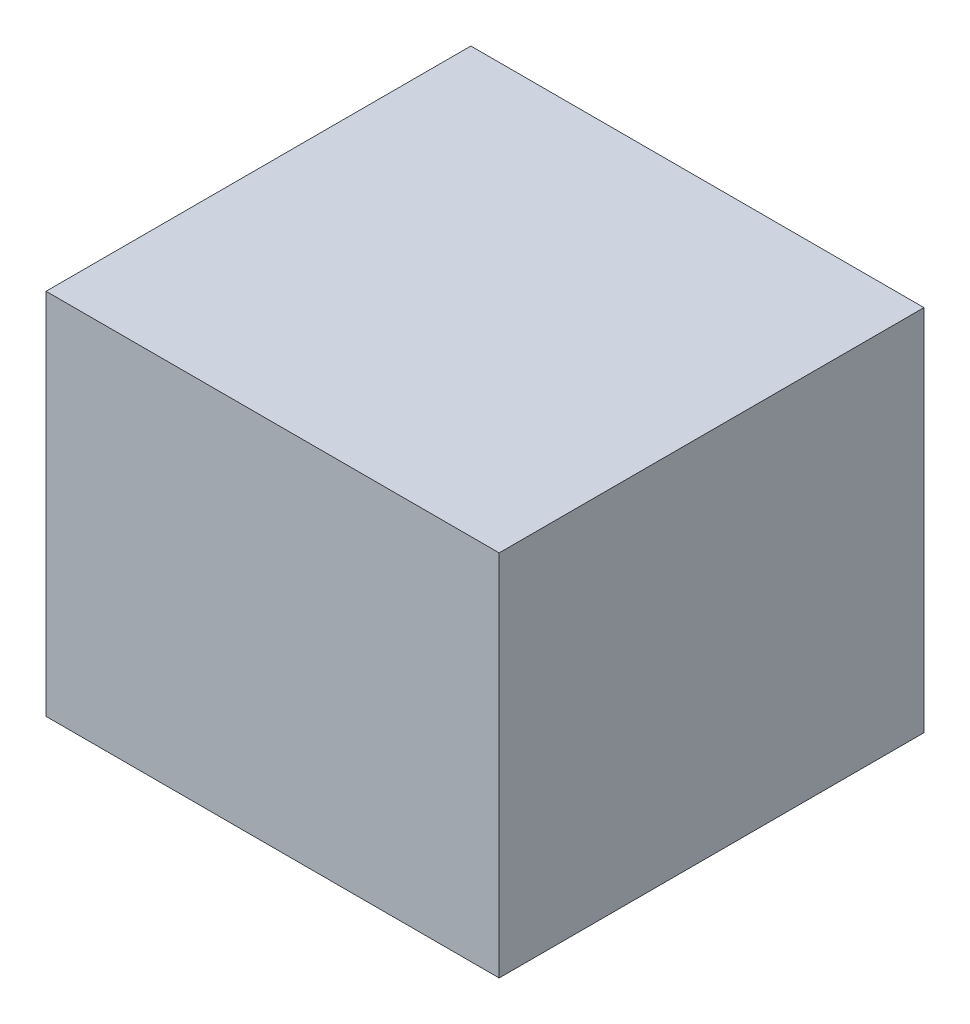
ISO-10303-21;
HEADER;
FILE_DESCRIPTION(('STEP AP214'),'2;1');
FILE_NAME('part.step','',(''),(''),'','','');
FILE_SCHEMA(('AUTOMOTIVE_DESIGN { 1 0 10303 214 1 1 1 1 }'));
ENDSEC;
DATA;
#1=APPLICATION_CONTEXT('core data for automotive mechanical design processes');
#2=APPLICATION_PROTOCOL_DEFINITION('international standard','automotive_design',2000,#1);
#3=PRODUCT_CONTEXT('',#1,'mechanical');
#4=PRODUCT('Part','Part','',(#3));
#5=PRODUCT_RELATED_PRODUCT_CATEGORY('part','',(#4));
#6=PRODUCT_DEFINITION_FORMATION('','',#4);
#7=PRODUCT_DEFINITION_CONTEXT('part definition',#1,'design');
#8=PRODUCT_DEFINITION('design','',#6,#7);
#9=PRODUCT_DEFINITION_SHAPE('','',#8);
#10=(LENGTH_UNIT() NAMED_UNIT(*) SI_UNIT(.MILLI.,.METRE.));
#11=(NAMED_UNIT(*) PLANE_ANGLE_UNIT() SI_UNIT($,.RADIAN.));
#12=(NAMED_UNIT(*) SI_UNIT($,.STERADIAN.) SOLID_ANGLE_UNIT());
#13=UNCERTAINTY_MEASURE_WITH_UNIT(LENGTH_MEASURE(1.E-05),#10,'distance_accuracy_value','');
#14=(GEOMETRIC_REPRESENTATION_CONTEXT(3) GLOBAL_UNCERTAINTY_ASSIGNED_CONTEXT((#13)) GLOBAL_UNIT_ASSIGNED_CONTEXT((#10,
#11,#12)) REPRESENTATION_CONTEXT('',''));
#15=CARTESIAN_POINT('',(0.,0.,0.));
#16=DIRECTION('',(0.,0.,1.));
#17=DIRECTION('',(1.,0.,0.));
#18=AXIS2_PLACEMENT_3D('',#15,#16,#17);
#19=CARTESIAN_POINT('',(0.,0.,47.625));
#20=DIRECTION('',(1.,0.,0.));
#21=DIRECTION('',(0.,1.,0.));
#22=AXIS2_PLACEMENT_3D('',#19,#20,#21);
#23=PLANE('',#22);
#24=DIRECTION('',(0.,-1.,0.));
#25=VECTOR('',#24,1.);
#26=CARTESIAN_POINT('',(0.,0.,0.));
#27=LINE('',#26,#25);
#28=CARTESIAN_POINT('',(0.,0.,0.));
#29=VERTEX_POINT('',#28);
#30=CARTESIAN_POINT('',(0.,-41.275,0.));
#31=VERTEX_POINT('',#30);
#32=EDGE_CURVE('E102',#29,#31,#27,.T.);
#33=ORIENTED_EDGE('',*,*,#32,.T.);
#34=DIRECTION('',(0.,0.,-1.));
#35=VECTOR('',#34,1.);
#36=CARTESIAN_POINT('',(0.,-41.275,47.625));
#37=LINE('',#36,#35);
#38=CARTESIAN_POINT('',(0.,-41.275,47.625));
#39=VERTEX_POINT('',#38);
#40=EDGE_CURVE('E11',#39,#31,#37,.T.);
#41=ORIENTED_EDGE('',*,*,#40,.F.);
#42=DIRECTION('',(0.,-1.,0.));
#43=VECTOR('',#42,1.);
#44=CARTESIAN_POINT('',(0.,0.,47.625));
#45=LINE('',#44,#43);
#46=CARTESIAN_POINT('',(0.,0.,47.625));
#47=VERTEX_POINT('',#46);
#48=EDGE_CURVE('E90',#47,#39,#45,.T.);
#49=ORIENTED_EDGE('',*,*,#48,.F.);
#50=DIRECTION('',(0.,0.,-1.));
#51=VECTOR('',#50,1.);
#52=CARTESIAN_POINT('',(0.,0.,47.625));
#53=LINE('',#52,#51);
#54=EDGE_CURVE('E98',#47,#29,#53,.T.);
#55=ORIENTED_EDGE('',*,*,#54,.T.);
#56=EDGE_LOOP('',(#33,#41,#49,#55));
#57=FACE_BOUND('',#56,.T.);
#58=ADVANCED_FACE('F39',(#57),#23,.F.);
#59=CARTESIAN_POINT('',(0.,-41.275,47.625));
#60=DIRECTION('',(0.,1.,0.));
#61=DIRECTION('',(0.,0.,1.));
#62=AXIS2_PLACEMENT_3D('',#59,#60,#61);
#63=PLANE('',#62);
#64=DIRECTION('',(1.,0.,0.));
#65=VECTOR('',#64,1.);
#66=CARTESIAN_POINT('',(0.,-41.275,0.));
#67=LINE('',#66,#65);
#68=CARTESIAN_POINT('',(50.8,-41.275,0.));
#69=VERTEX_POINT('',#68);
#70=EDGE_CURVE('E94',#31,#69,#67,.T.);
#71=ORIENTED_EDGE('',*,*,#70,.T.);
#72=DIRECTION('',(0.,0.,-1.));
#73=VECTOR('',#72,1.);
#74=CARTESIAN_POINT('',(50.8,-41.275,47.625));
#75=LINE('',#74,#73);
#76=CARTESIAN_POINT('',(50.8,-41.275,47.625));
#77=VERTEX_POINT('',#76);
#78=EDGE_CURVE('E47',#77,#69,#75,.T.);
#79=ORIENTED_EDGE('',*,*,#78,.F.);
#80=DIRECTION('',(1.,0.,0.));
#81=VECTOR('',#80,1.);
#82=CARTESIAN_POINT('',(0.,-41.275,47.625));
#83=LINE('',#82,#81);
#84=EDGE_CURVE('E85',#39,#77,#83,.T.);
#85=ORIENTED_EDGE('',*,*,#84,.F.);
#86=ORIENTED_EDGE('',*,*,#40,.T.);
#87=EDGE_LOOP('',(#71,#79,#85,#86));
#88=FACE_BOUND('',#87,.T.);
#89=ADVANCED_FACE('F93',(#88),#63,.F.);
#90=CARTESIAN_POINT('',(50.8,0.,47.625));
#91=DIRECTION('',(-1.,0.,0.));
#92=DIRECTION('',(0.,-1.,0.));
#93=AXIS2_PLACEMENT_3D('',#90,#91,#92);
#94=PLANE('',#93);
#95=DIRECTION('',(0.,1.,0.));
#96=VECTOR('',#95,1.);
#97=CARTESIAN_POINT('',(50.8,0.,0.));
#98=LINE('',#97,#96);
#99=CARTESIAN_POINT('',(50.8,0.,0.));
#100=VERTEX_POINT('',#99);
#101=EDGE_CURVE('E72',#69,#100,#98,.T.);
#102=ORIENTED_EDGE('',*,*,#101,.T.);
#103=DIRECTION('',(0.,0.,-1.));
#104=VECTOR('',#103,1.);
#105=CARTESIAN_POINT('',(50.8,0.,47.625));
#106=LINE('',#105,#104);
#107=CARTESIAN_POINT('',(50.8,0.,47.625));
#108=VERTEX_POINT('',#107);
#109=EDGE_CURVE('E95',#108,#100,#106,.T.);
#110=ORIENTED_EDGE('',*,*,#109,.F.);
#111=DIRECTION('',(0.,1.,0.));
#112=VECTOR('',#111,1.);
#113=CARTESIAN_POINT('',(50.8,0.,47.625));
#114=LINE('',#113,#112);
#115=EDGE_CURVE('E88',#77,#108,#114,.T.);
#116=ORIENTED_EDGE('',*,*,#115,.F.);
#117=ORIENTED_EDGE('',*,*,#78,.T.);
#118=EDGE_LOOP('',(#102,#110,#116,#117));
#119=FACE_BOUND('',#118,.T.);
#120=ADVANCED_FACE('F96',(#119),#94,.F.);
#121=CARTESIAN_POINT('',(0.,0.,47.625));
#122=DIRECTION('',(0.,-1.,0.));
#123=DIRECTION('',(0.,0.,-1.));
#124=AXIS2_PLACEMENT_3D('',#121,#122,#123);
#125=PLANE('',#124);
#126=DIRECTION('',(-1.,0.,0.));
#127=VECTOR('',#126,1.);
#128=CARTESIAN_POINT('',(0.,0.,0.));
#129=LINE('',#128,#127);
#130=EDGE_CURVE('E78',#100,#29,#129,.T.);
#131=ORIENTED_EDGE('',*,*,#130,.T.);
#132=ORIENTED_EDGE('',*,*,#54,.F.);
#133=DIRECTION('',(-1.,0.,0.));
#134=VECTOR('',#133,1.);
#135=CARTESIAN_POINT('',(0.,0.,47.625));
#136=LINE('',#135,#134);
#137=EDGE_CURVE('E55',#108,#47,#136,.T.);
#138=ORIENTED_EDGE('',*,*,#137,.F.);
#139=ORIENTED_EDGE('',*,*,#109,.T.);
#140=EDGE_LOOP('',(#131,#132,#138,#139));
#141=FACE_BOUND('',#140,.T.);
#142=ADVANCED_FACE('F109',(#141),#125,.F.);
#143=CARTESIAN_POINT('',(0.,0.,47.625));
#144=DIRECTION('',(0.,0.,1.));
#145=DIRECTION('',(1.,0.,0.));
#146=AXIS2_PLACEMENT_3D('',#143,#144,#145);
#147=PLANE('',#146);
#148=ORIENTED_EDGE('',*,*,#48,.T.);
#149=ORIENTED_EDGE('',*,*,#84,.T.);
#150=ORIENTED_EDGE('',*,*,#115,.T.);
#151=ORIENTED_EDGE('',*,*,#137,.T.);
#152=EDGE_LOOP('',(#148,#149,#150,#151));
#153=FACE_BOUND('',#152,.T.);
#154=ADVANCED_FACE('F86',(#153),#147,.T.);
#155=CARTESIAN_POINT('',(0.,0.,0.));
#156=DIRECTION('',(0.,0.,1.));
#157=DIRECTION('',(1.,0.,0.));
#158=AXIS2_PLACEMENT_3D('',#155,#156,#157);
#159=PLANE('',#158);
#160=ORIENTED_EDGE('',*,*,#32,.F.);
#161=ORIENTED_EDGE('',*,*,#130,.F.);
#162=ORIENTED_EDGE('',*,*,#101,.F.);
#163=ORIENTED_EDGE('',*,*,#70,.F.);
#164=EDGE_LOOP('',(#160,#161,#162,#163));
#165=FACE_BOUND('',#164,.T.);
#166=ADVANCED_FACE('F112',(#165),#159,.F.);
#167=CLOSED_SHELL('',(#58,#89,#120,#142,#154,#166));
#168=MANIFOLD_SOLID_BREP('B2',#167);
#169=ADVANCED_BREP_SHAPE_REPRESENTATION('',(#18,#168),#14);
#170=SHAPE_DEFINITION_REPRESENTATION(#9,#169);
ENDSEC;
END-ISO-10303-21;
